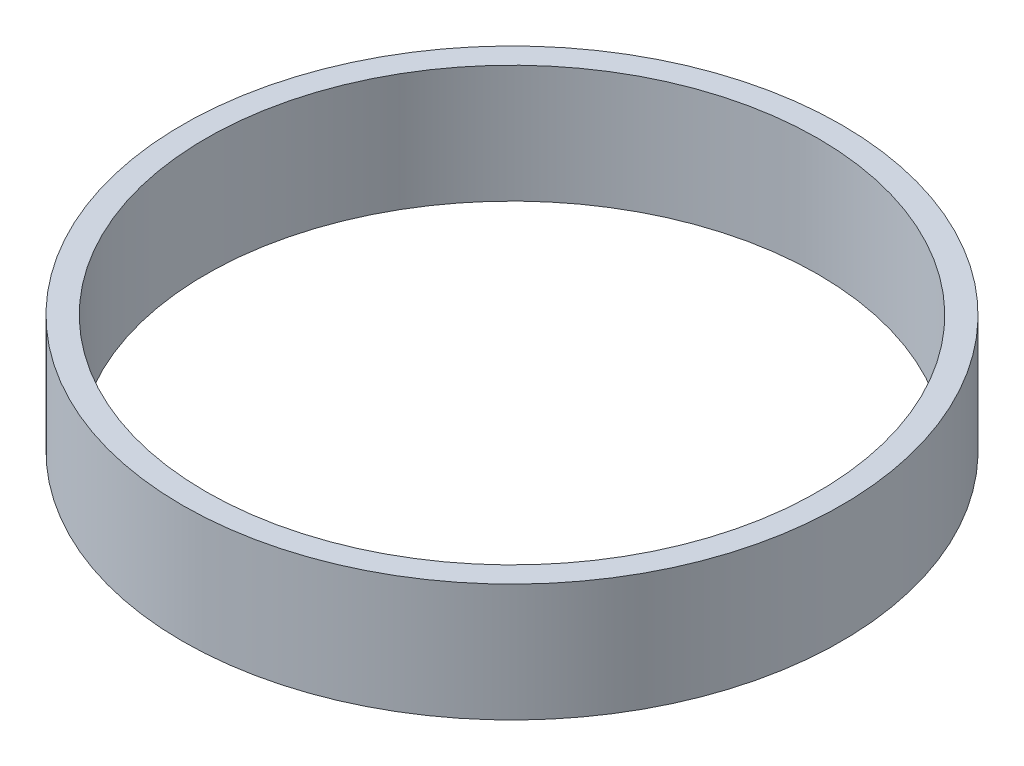
ISO-10303-21;
HEADER;
FILE_DESCRIPTION(('STEP AP214'),'2;1');
FILE_NAME('part.step','',(''),(''),'','','');
FILE_SCHEMA(('AUTOMOTIVE_DESIGN { 1 0 10303 214 1 1 1 1 }'));
ENDSEC;
DATA;
#1=APPLICATION_CONTEXT('core data for automotive mechanical design processes');
#2=APPLICATION_PROTOCOL_DEFINITION('international standard','automotive_design',2000,#1);
#3=PRODUCT_CONTEXT('',#1,'mechanical');
#4=PRODUCT('Part','Part','',(#3));
#5=PRODUCT_RELATED_PRODUCT_CATEGORY('part','',(#4));
#6=PRODUCT_DEFINITION_FORMATION('','',#4);
#7=PRODUCT_DEFINITION_CONTEXT('part definition',#1,'design');
#8=PRODUCT_DEFINITION('design','',#6,#7);
#9=PRODUCT_DEFINITION_SHAPE('','',#8);
#10=(LENGTH_UNIT() NAMED_UNIT(*) SI_UNIT(.MILLI.,.METRE.));
#11=(NAMED_UNIT(*) PLANE_ANGLE_UNIT() SI_UNIT($,.RADIAN.));
#12=(NAMED_UNIT(*) SI_UNIT($,.STERADIAN.) SOLID_ANGLE_UNIT());
#13=UNCERTAINTY_MEASURE_WITH_UNIT(LENGTH_MEASURE(1.E-05),#10,'distance_accuracy_value','');
#14=(GEOMETRIC_REPRESENTATION_CONTEXT(3) GLOBAL_UNCERTAINTY_ASSIGNED_CONTEXT((#13)) GLOBAL_UNIT_ASSIGNED_CONTEXT((#10,
#11,#12)) REPRESENTATION_CONTEXT('',''));
#15=CARTESIAN_POINT('',(0.,0.,0.));
#16=DIRECTION('',(0.,0.,1.));
#17=DIRECTION('',(1.,0.,0.));
#18=AXIS2_PLACEMENT_3D('',#15,#16,#17);
#19=CARTESIAN_POINT('',(0.,12.5,0.));
#20=DIRECTION('',(0.,1.,0.));
#21=DIRECTION('',(0.,0.,1.));
#22=AXIS2_PLACEMENT_3D('',#19,#20,#21);
#23=PLANE('',#22);
#24=CARTESIAN_POINT('',(0.,12.5,0.));
#25=DIRECTION('',(0.,1.,0.));
#26=DIRECTION('',(0.,0.,1.));
#27=AXIS2_PLACEMENT_3D('',#24,#25,#26);
#28=CIRCLE('',#27,35.);
#29=CARTESIAN_POINT('',(0.,12.5,35.));
#30=VERTEX_POINT('',#29);
#31=EDGE_CURVE('E10',#30,#30,#28,.T.);
#32=ORIENTED_EDGE('',*,*,#31,.T.);
#33=EDGE_LOOP('',(#32));
#34=FACE_BOUND('',#33,.T.);
#35=CARTESIAN_POINT('',(0.,12.5,0.));
#36=DIRECTION('',(0.,1.,0.));
#37=DIRECTION('',(0.,0.,1.));
#38=AXIS2_PLACEMENT_3D('',#35,#36,#37);
#39=CIRCLE('',#38,32.5);
#40=CARTESIAN_POINT('',(0.,12.5,32.5));
#41=VERTEX_POINT('',#40);
#42=EDGE_CURVE('E45',#41,#41,#39,.T.);
#43=ORIENTED_EDGE('',*,*,#42,.F.);
#44=EDGE_LOOP('',(#43));
#45=FACE_BOUND('',#44,.T.);
#46=ADVANCED_FACE('F34',(#34,#45),#23,.T.);
#47=CARTESIAN_POINT('',(0.,0.,0.));
#48=DIRECTION('',(0.,1.,0.));
#49=DIRECTION('',(0.,0.,1.));
#50=AXIS2_PLACEMENT_3D('',#47,#48,#49);
#51=PLANE('',#50);
#52=CARTESIAN_POINT('',(0.,0.,0.));
#53=DIRECTION('',(0.,1.,0.));
#54=DIRECTION('',(0.,0.,1.));
#55=AXIS2_PLACEMENT_3D('',#52,#53,#54);
#56=CIRCLE('',#55,35.);
#57=CARTESIAN_POINT('',(0.,0.,35.));
#58=VERTEX_POINT('',#57);
#59=EDGE_CURVE('E38',#58,#58,#56,.T.);
#60=ORIENTED_EDGE('',*,*,#59,.F.);
#61=EDGE_LOOP('',(#60));
#62=FACE_BOUND('',#61,.T.);
#63=CARTESIAN_POINT('',(0.,0.,0.));
#64=DIRECTION('',(0.,1.,0.));
#65=DIRECTION('',(0.,0.,1.));
#66=AXIS2_PLACEMENT_3D('',#63,#64,#65);
#67=CIRCLE('',#66,32.5);
#68=CARTESIAN_POINT('',(0.,0.,32.5));
#69=VERTEX_POINT('',#68);
#70=EDGE_CURVE('E47',#69,#69,#67,.T.);
#71=ORIENTED_EDGE('',*,*,#70,.T.);
#72=EDGE_LOOP('',(#71));
#73=FACE_BOUND('',#72,.T.);
#74=ADVANCED_FACE('F57',(#62,#73),#51,.F.);
#75=CARTESIAN_POINT('',(0.,12.5,0.));
#76=DIRECTION('',(0.,-1.,0.));
#77=DIRECTION('',(0.,0.,-1.));
#78=AXIS2_PLACEMENT_3D('',#75,#76,#77);
#79=CYLINDRICAL_SURFACE('',#78,35.);
#80=ORIENTED_EDGE('',*,*,#31,.F.);
#81=EDGE_LOOP('',(#80));
#82=FACE_BOUND('',#81,.T.);
#83=ORIENTED_EDGE('',*,*,#59,.T.);
#84=EDGE_LOOP('',(#83));
#85=FACE_BOUND('',#84,.T.);
#86=ADVANCED_FACE('F36',(#82,#85),#79,.T.);
#87=CARTESIAN_POINT('',(0.,12.5,0.));
#88=DIRECTION('',(0.,-1.,0.));
#89=DIRECTION('',(0.,0.,-1.));
#90=AXIS2_PLACEMENT_3D('',#87,#88,#89);
#91=CYLINDRICAL_SURFACE('',#90,32.5);
#92=ORIENTED_EDGE('',*,*,#42,.T.);
#93=EDGE_LOOP('',(#92));
#94=FACE_BOUND('',#93,.T.);
#95=ORIENTED_EDGE('',*,*,#70,.F.);
#96=EDGE_LOOP('',(#95));
#97=FACE_BOUND('',#96,.T.);
#98=ADVANCED_FACE('F53',(#94,#97),#91,.F.);
#99=CLOSED_SHELL('',(#46,#74,#86,#98));
#100=MANIFOLD_SOLID_BREP('B2',#99);
#101=ADVANCED_BREP_SHAPE_REPRESENTATION('',(#18,#100),#14);
#102=SHAPE_DEFINITION_REPRESENTATION(#9,#101);
ENDSEC;
END-ISO-10303-21;
